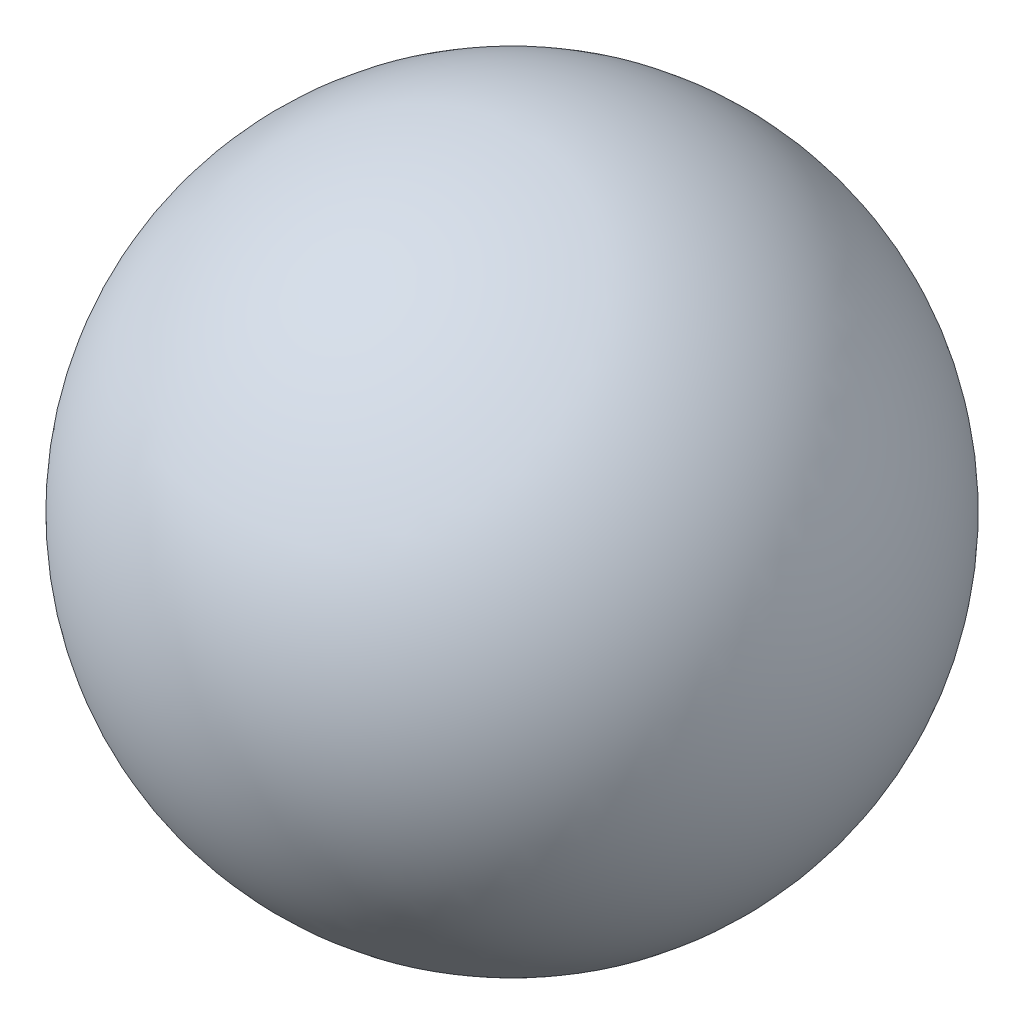
ISO-10303-21;
HEADER;
FILE_DESCRIPTION(('STEP AP214'),'2;1');
FILE_NAME('part.step','',(''),(''),'','','');
FILE_SCHEMA(('AUTOMOTIVE_DESIGN { 1 0 10303 214 1 1 1 1 }'));
ENDSEC;
DATA;
#1=APPLICATION_CONTEXT('core data for automotive mechanical design processes');
#2=APPLICATION_PROTOCOL_DEFINITION('international standard','automotive_design',2000,#1);
#3=PRODUCT_CONTEXT('',#1,'mechanical');
#4=PRODUCT('Part','Part','',(#3));
#5=PRODUCT_RELATED_PRODUCT_CATEGORY('part','',(#4));
#6=PRODUCT_DEFINITION_FORMATION('','',#4);
#7=PRODUCT_DEFINITION_CONTEXT('part definition',#1,'design');
#8=PRODUCT_DEFINITION('design','',#6,#7);
#9=PRODUCT_DEFINITION_SHAPE('','',#8);
#10=(LENGTH_UNIT() NAMED_UNIT(*) SI_UNIT(.MILLI.,.METRE.));
#11=(NAMED_UNIT(*) PLANE_ANGLE_UNIT() SI_UNIT($,.RADIAN.));
#12=(NAMED_UNIT(*) SI_UNIT($,.STERADIAN.) SOLID_ANGLE_UNIT());
#13=UNCERTAINTY_MEASURE_WITH_UNIT(LENGTH_MEASURE(1.E-05),#10,'distance_accuracy_value','');
#14=(GEOMETRIC_REPRESENTATION_CONTEXT(3) GLOBAL_UNCERTAINTY_ASSIGNED_CONTEXT((#13)) GLOBAL_UNIT_ASSIGNED_CONTEXT((#10,
#11,#12)) REPRESENTATION_CONTEXT('',''));
#15=CARTESIAN_POINT('',(0.,0.,0.));
#16=DIRECTION('',(0.,0.,1.));
#17=DIRECTION('',(1.,0.,0.));
#18=AXIS2_PLACEMENT_3D('',#15,#16,#17);
#19=CARTESIAN_POINT('',(0.,0.,0.));
#20=DIRECTION('',(0.,1.,0.));
#21=DIRECTION('',(1.,0.,0.));
#22=AXIS2_PLACEMENT_3D('',#19,#20,#21);
#23=SPHERICAL_SURFACE('',#22,3.4326529);
#24=CARTESIAN_POINT('',(0.,3.4326529,0.));
#25=VERTEX_POINT('',#24);
#26=VERTEX_LOOP('',#25);
#27=FACE_BOUND('',#26,.T.);
#28=ADVANCED_FACE('F29',(#27),#23,.T.);
#29=CLOSED_SHELL('',(#28));
#30=MANIFOLD_SOLID_BREP('B2',#29);
#31=ADVANCED_BREP_SHAPE_REPRESENTATION('',(#18,#30),#14);
#32=SHAPE_DEFINITION_REPRESENTATION(#9,#31);
ENDSEC;
END-ISO-10303-21;
